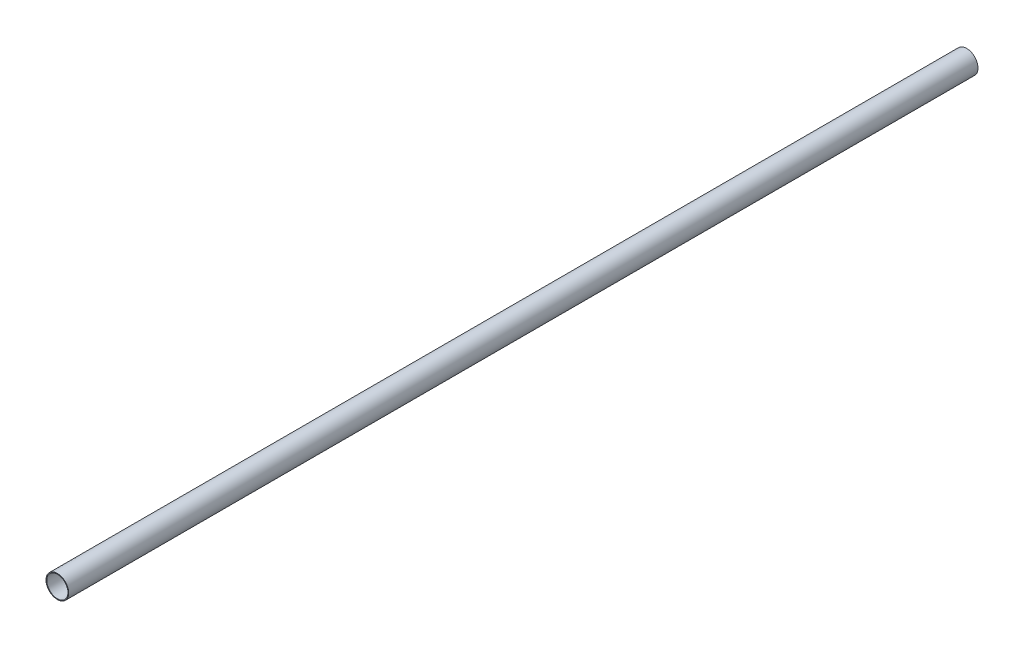
ISO-10303-21;
HEADER;
FILE_DESCRIPTION(('STEP AP214'),'2;1');
FILE_NAME('part.step','',(''),(''),'','','');
FILE_SCHEMA(('AUTOMOTIVE_DESIGN { 1 0 10303 214 1 1 1 1 }'));
ENDSEC;
DATA;
#1=APPLICATION_CONTEXT('core data for automotive mechanical design processes');
#2=APPLICATION_PROTOCOL_DEFINITION('international standard','automotive_design',2000,#1);
#3=PRODUCT_CONTEXT('',#1,'mechanical');
#4=PRODUCT('Part','Part','',(#3));
#5=PRODUCT_RELATED_PRODUCT_CATEGORY('part','',(#4));
#6=PRODUCT_DEFINITION_FORMATION('','',#4);
#7=PRODUCT_DEFINITION_CONTEXT('part definition',#1,'design');
#8=PRODUCT_DEFINITION('design','',#6,#7);
#9=PRODUCT_DEFINITION_SHAPE('','',#8);
#10=(LENGTH_UNIT() NAMED_UNIT(*) SI_UNIT(.MILLI.,.METRE.));
#11=(NAMED_UNIT(*) PLANE_ANGLE_UNIT() SI_UNIT($,.RADIAN.));
#12=(NAMED_UNIT(*) SI_UNIT($,.STERADIAN.) SOLID_ANGLE_UNIT());
#13=UNCERTAINTY_MEASURE_WITH_UNIT(LENGTH_MEASURE(1.E-05),#10,'distance_accuracy_value','');
#14=(GEOMETRIC_REPRESENTATION_CONTEXT(3) GLOBAL_UNCERTAINTY_ASSIGNED_CONTEXT((#13)) GLOBAL_UNIT_ASSIGNED_CONTEXT((#10,
#11,#12)) REPRESENTATION_CONTEXT('',''));
#15=CARTESIAN_POINT('',(0.,0.,0.));
#16=DIRECTION('',(0.,0.,1.));
#17=DIRECTION('',(1.,0.,0.));
#18=AXIS2_PLACEMENT_3D('',#15,#16,#17);
#19=CARTESIAN_POINT('',(0.,0.,1200.));
#20=DIRECTION('',(0.,0.,1.));
#21=DIRECTION('',(1.,0.,0.));
#22=AXIS2_PLACEMENT_3D('',#19,#20,#21);
#23=PLANE('',#22);
#24=CARTESIAN_POINT('',(0.,0.,1200.));
#25=DIRECTION('',(0.,0.,1.));
#26=DIRECTION('',(1.,0.,0.));
#27=AXIS2_PLACEMENT_3D('',#24,#25,#26);
#28=CIRCLE('',#27,15.);
#29=CARTESIAN_POINT('',(15.,0.,1200.));
#30=VERTEX_POINT('',#29);
#31=EDGE_CURVE('E10',#30,#30,#28,.T.);
#32=ORIENTED_EDGE('',*,*,#31,.T.);
#33=EDGE_LOOP('',(#32));
#34=FACE_BOUND('',#33,.T.);
#35=CARTESIAN_POINT('',(0.,0.,1200.));
#36=DIRECTION('',(0.,0.,1.));
#37=DIRECTION('',(1.,0.,0.));
#38=AXIS2_PLACEMENT_3D('',#35,#36,#37);
#39=CIRCLE('',#38,14.);
#40=CARTESIAN_POINT('',(14.,0.,1200.));
#41=VERTEX_POINT('',#40);
#42=EDGE_CURVE('E45',#41,#41,#39,.T.);
#43=ORIENTED_EDGE('',*,*,#42,.F.);
#44=EDGE_LOOP('',(#43));
#45=FACE_BOUND('',#44,.T.);
#46=ADVANCED_FACE('F34',(#34,#45),#23,.T.);
#47=CARTESIAN_POINT('',(0.,0.,0.));
#48=DIRECTION('',(0.,0.,1.));
#49=DIRECTION('',(1.,0.,0.));
#50=AXIS2_PLACEMENT_3D('',#47,#48,#49);
#51=PLANE('',#50);
#52=CARTESIAN_POINT('',(0.,0.,0.));
#53=DIRECTION('',(0.,0.,1.));
#54=DIRECTION('',(1.,0.,0.));
#55=AXIS2_PLACEMENT_3D('',#52,#53,#54);
#56=CIRCLE('',#55,15.);
#57=CARTESIAN_POINT('',(15.,0.,0.));
#58=VERTEX_POINT('',#57);
#59=EDGE_CURVE('E38',#58,#58,#56,.T.);
#60=ORIENTED_EDGE('',*,*,#59,.F.);
#61=EDGE_LOOP('',(#60));
#62=FACE_BOUND('',#61,.T.);
#63=CARTESIAN_POINT('',(0.,0.,0.));
#64=DIRECTION('',(0.,0.,1.));
#65=DIRECTION('',(1.,0.,0.));
#66=AXIS2_PLACEMENT_3D('',#63,#64,#65);
#67=CIRCLE('',#66,14.);
#68=CARTESIAN_POINT('',(14.,0.,0.));
#69=VERTEX_POINT('',#68);
#70=EDGE_CURVE('E47',#69,#69,#67,.T.);
#71=ORIENTED_EDGE('',*,*,#70,.T.);
#72=EDGE_LOOP('',(#71));
#73=FACE_BOUND('',#72,.T.);
#74=ADVANCED_FACE('F57',(#62,#73),#51,.F.);
#75=CARTESIAN_POINT('',(0.,0.,1200.));
#76=DIRECTION('',(0.,0.,-1.));
#77=DIRECTION('',(-1.,0.,0.));
#78=AXIS2_PLACEMENT_3D('',#75,#76,#77);
#79=CYLINDRICAL_SURFACE('',#78,15.);
#80=ORIENTED_EDGE('',*,*,#31,.F.);
#81=EDGE_LOOP('',(#80));
#82=FACE_BOUND('',#81,.T.);
#83=ORIENTED_EDGE('',*,*,#59,.T.);
#84=EDGE_LOOP('',(#83));
#85=FACE_BOUND('',#84,.T.);
#86=ADVANCED_FACE('F36',(#82,#85),#79,.T.);
#87=CARTESIAN_POINT('',(0.,0.,1200.));
#88=DIRECTION('',(0.,0.,-1.));
#89=DIRECTION('',(-1.,0.,0.));
#90=AXIS2_PLACEMENT_3D('',#87,#88,#89);
#91=CYLINDRICAL_SURFACE('',#90,14.);
#92=ORIENTED_EDGE('',*,*,#42,.T.);
#93=EDGE_LOOP('',(#92));
#94=FACE_BOUND('',#93,.T.);
#95=ORIENTED_EDGE('',*,*,#70,.F.);
#96=EDGE_LOOP('',(#95));
#97=FACE_BOUND('',#96,.T.);
#98=ADVANCED_FACE('F53',(#94,#97),#91,.F.);
#99=CLOSED_SHELL('',(#46,#74,#86,#98));
#100=MANIFOLD_SOLID_BREP('B2',#99);
#101=ADVANCED_BREP_SHAPE_REPRESENTATION('',(#18,#100),#14);
#102=SHAPE_DEFINITION_REPRESENTATION(#9,#101);
ENDSEC;
END-ISO-10303-21;
